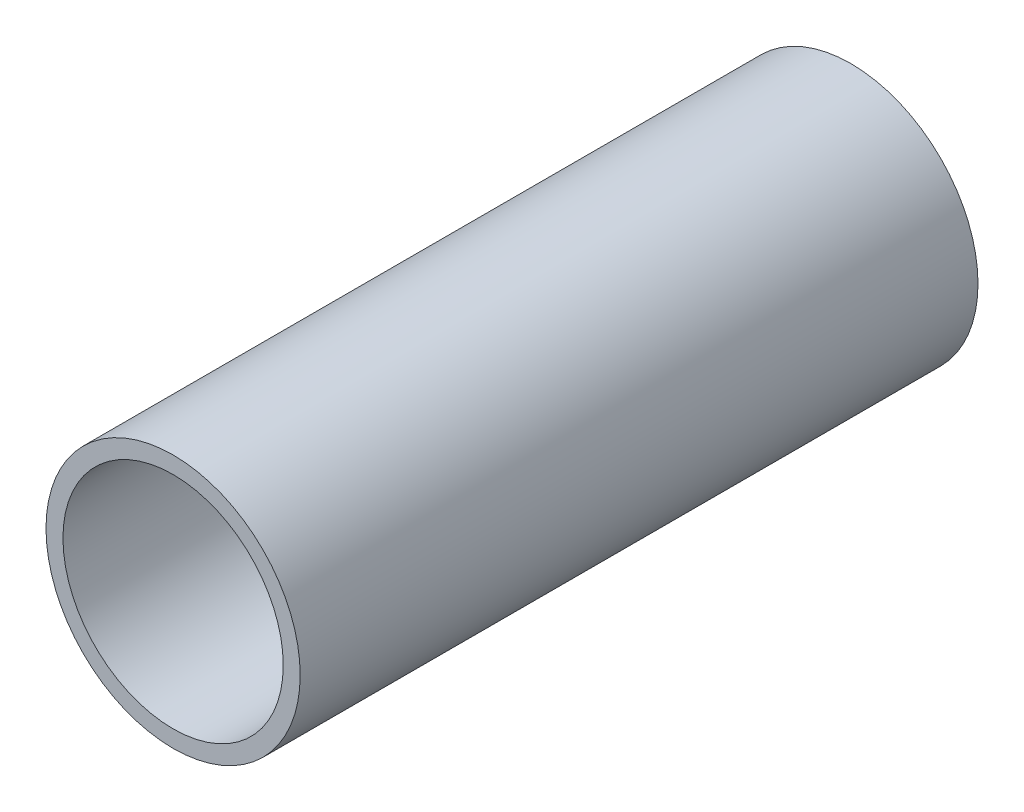
ISO-10303-21;
HEADER;
FILE_DESCRIPTION(('STEP AP214'),'2;1');
FILE_NAME('part.step','',(''),(''),'','','');
FILE_SCHEMA(('AUTOMOTIVE_DESIGN { 1 0 10303 214 1 1 1 1 }'));
ENDSEC;
DATA;
#1=APPLICATION_CONTEXT('core data for automotive mechanical design processes');
#2=APPLICATION_PROTOCOL_DEFINITION('international standard','automotive_design',2000,#1);
#3=PRODUCT_CONTEXT('',#1,'mechanical');
#4=PRODUCT('Part','Part','',(#3));
#5=PRODUCT_RELATED_PRODUCT_CATEGORY('part','',(#4));
#6=PRODUCT_DEFINITION_FORMATION('','',#4);
#7=PRODUCT_DEFINITION_CONTEXT('part definition',#1,'design');
#8=PRODUCT_DEFINITION('design','',#6,#7);
#9=PRODUCT_DEFINITION_SHAPE('','',#8);
#10=(LENGTH_UNIT() NAMED_UNIT(*) SI_UNIT(.MILLI.,.METRE.));
#11=(NAMED_UNIT(*) PLANE_ANGLE_UNIT() SI_UNIT($,.RADIAN.));
#12=(NAMED_UNIT(*) SI_UNIT($,.STERADIAN.) SOLID_ANGLE_UNIT());
#13=UNCERTAINTY_MEASURE_WITH_UNIT(LENGTH_MEASURE(1.E-05),#10,'distance_accuracy_value','');
#14=(GEOMETRIC_REPRESENTATION_CONTEXT(3) GLOBAL_UNCERTAINTY_ASSIGNED_CONTEXT((#13)) GLOBAL_UNIT_ASSIGNED_CONTEXT((#10,
#11,#12)) REPRESENTATION_CONTEXT('',''));
#15=CARTESIAN_POINT('',(0.,0.,0.));
#16=DIRECTION('',(0.,0.,1.));
#17=DIRECTION('',(1.,0.,0.));
#18=AXIS2_PLACEMENT_3D('',#15,#16,#17);
#19=CARTESIAN_POINT('',(0.,0.,-80.));
#20=DIRECTION('',(0.,0.,1.));
#21=DIRECTION('',(1.,0.,0.));
#22=AXIS2_PLACEMENT_3D('',#19,#20,#21);
#23=CYLINDRICAL_SURFACE('',#22,15.);
#24=CARTESIAN_POINT('',(0.,0.,-80.));
#25=DIRECTION('',(0.,0.,1.));
#26=DIRECTION('',(1.,0.,0.));
#27=AXIS2_PLACEMENT_3D('',#24,#25,#26);
#28=CIRCLE('',#27,15.);
#29=CARTESIAN_POINT('',(15.,0.,-80.));
#30=VERTEX_POINT('',#29);
#31=EDGE_CURVE('E10',#30,#30,#28,.T.);
#32=ORIENTED_EDGE('',*,*,#31,.T.);
#33=EDGE_LOOP('',(#32));
#34=FACE_BOUND('',#33,.T.);
#35=CARTESIAN_POINT('',(0.,0.,0.));
#36=DIRECTION('',(0.,0.,1.));
#37=DIRECTION('',(1.,0.,0.));
#38=AXIS2_PLACEMENT_3D('',#35,#36,#37);
#39=CIRCLE('',#38,15.);
#40=CARTESIAN_POINT('',(15.,0.,0.));
#41=VERTEX_POINT('',#40);
#42=EDGE_CURVE('E37',#41,#41,#39,.T.);
#43=ORIENTED_EDGE('',*,*,#42,.F.);
#44=EDGE_LOOP('',(#43));
#45=FACE_BOUND('',#44,.T.);
#46=ADVANCED_FACE('F34',(#34,#45),#23,.T.);
#47=CARTESIAN_POINT('',(0.,0.,-80.));
#48=DIRECTION('',(0.,0.,1.));
#49=DIRECTION('',(1.,0.,0.));
#50=AXIS2_PLACEMENT_3D('',#47,#48,#49);
#51=PLANE('',#50);
#52=CARTESIAN_POINT('',(0.,0.,-80.));
#53=DIRECTION('',(0.,0.,1.));
#54=DIRECTION('',(1.,0.,0.));
#55=AXIS2_PLACEMENT_3D('',#52,#53,#54);
#56=CIRCLE('',#55,13.);
#57=CARTESIAN_POINT('',(13.,0.,-80.));
#58=VERTEX_POINT('',#57);
#59=EDGE_CURVE('E44',#58,#58,#56,.T.);
#60=ORIENTED_EDGE('',*,*,#59,.T.);
#61=EDGE_LOOP('',(#60));
#62=FACE_BOUND('',#61,.T.);
#63=ORIENTED_EDGE('',*,*,#31,.F.);
#64=EDGE_LOOP('',(#63));
#65=FACE_BOUND('',#64,.T.);
#66=ADVANCED_FACE('F52',(#62,#65),#51,.F.);
#67=CARTESIAN_POINT('',(0.,0.,0.));
#68=DIRECTION('',(0.,0.,1.));
#69=DIRECTION('',(1.,0.,0.));
#70=AXIS2_PLACEMENT_3D('',#67,#68,#69);
#71=PLANE('',#70);
#72=CARTESIAN_POINT('',(0.,0.,0.));
#73=DIRECTION('',(0.,0.,1.));
#74=DIRECTION('',(1.,0.,0.));
#75=AXIS2_PLACEMENT_3D('',#72,#73,#74);
#76=CIRCLE('',#75,13.);
#77=CARTESIAN_POINT('',(13.,0.,0.));
#78=VERTEX_POINT('',#77);
#79=EDGE_CURVE('E46',#78,#78,#76,.T.);
#80=ORIENTED_EDGE('',*,*,#79,.F.);
#81=EDGE_LOOP('',(#80));
#82=FACE_BOUND('',#81,.T.);
#83=ORIENTED_EDGE('',*,*,#42,.T.);
#84=EDGE_LOOP('',(#83));
#85=FACE_BOUND('',#84,.T.);
#86=ADVANCED_FACE('F58',(#82,#85),#71,.T.);
#87=CARTESIAN_POINT('',(0.,0.,-80.));
#88=DIRECTION('',(0.,0.,1.));
#89=DIRECTION('',(1.,0.,0.));
#90=AXIS2_PLACEMENT_3D('',#87,#88,#89);
#91=CYLINDRICAL_SURFACE('',#90,13.);
#92=ORIENTED_EDGE('',*,*,#59,.F.);
#93=EDGE_LOOP('',(#92));
#94=FACE_BOUND('',#93,.T.);
#95=ORIENTED_EDGE('',*,*,#79,.T.);
#96=EDGE_LOOP('',(#95));
#97=FACE_BOUND('',#96,.T.);
#98=ADVANCED_FACE('F55',(#94,#97),#91,.F.);
#99=CLOSED_SHELL('',(#46,#66,#86,#98));
#100=MANIFOLD_SOLID_BREP('B2',#99);
#101=ADVANCED_BREP_SHAPE_REPRESENTATION('',(#18,#100),#14);
#102=SHAPE_DEFINITION_REPRESENTATION(#9,#101);
ENDSEC;
END-ISO-10303-21;
